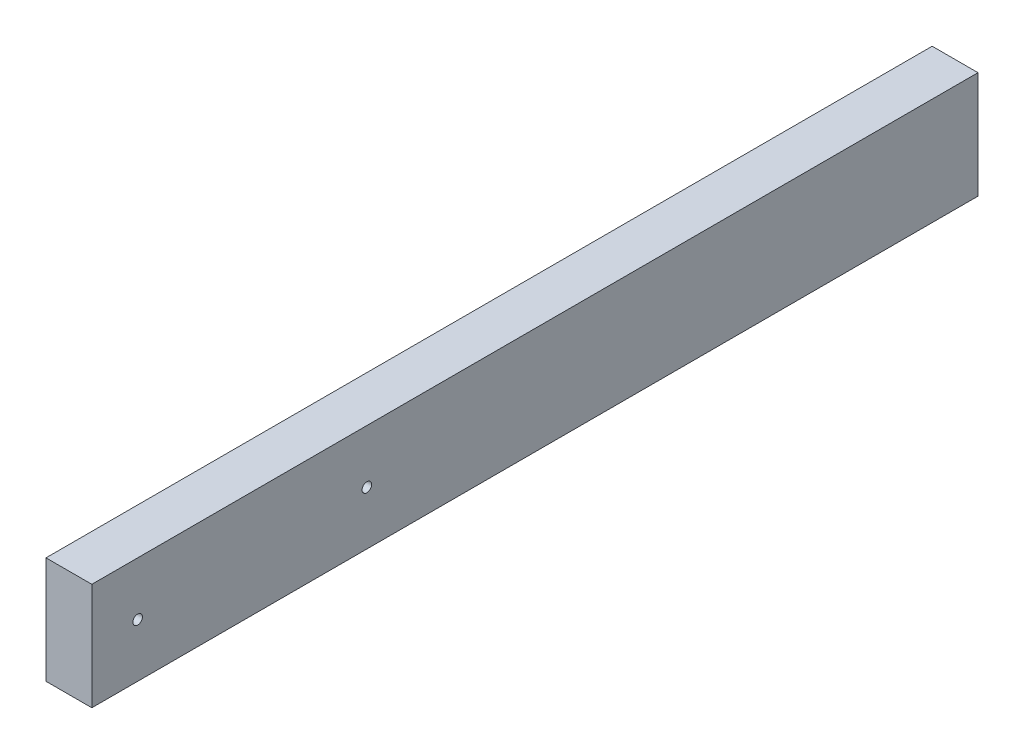
ISO-10303-21;
HEADER;
FILE_DESCRIPTION(('STEP AP214'),'2;1');
FILE_NAME('part.step','',(''),(''),'','','');
FILE_SCHEMA(('AUTOMOTIVE_DESIGN { 1 0 10303 214 1 1 1 1 }'));
ENDSEC;
DATA;
#1=APPLICATION_CONTEXT('core data for automotive mechanical design processes');
#2=APPLICATION_PROTOCOL_DEFINITION('international standard','automotive_design',2000,#1);
#3=PRODUCT_CONTEXT('',#1,'mechanical');
#4=PRODUCT('Part','Part','',(#3));
#5=PRODUCT_RELATED_PRODUCT_CATEGORY('part','',(#4));
#6=PRODUCT_DEFINITION_FORMATION('','',#4);
#7=PRODUCT_DEFINITION_CONTEXT('part definition',#1,'design');
#8=PRODUCT_DEFINITION('design','',#6,#7);
#9=PRODUCT_DEFINITION_SHAPE('','',#8);
#10=(LENGTH_UNIT() NAMED_UNIT(*) SI_UNIT(.MILLI.,.METRE.));
#11=(NAMED_UNIT(*) PLANE_ANGLE_UNIT() SI_UNIT($,.RADIAN.));
#12=(NAMED_UNIT(*) SI_UNIT($,.STERADIAN.) SOLID_ANGLE_UNIT());
#13=UNCERTAINTY_MEASURE_WITH_UNIT(LENGTH_MEASURE(1.E-05),#10,'distance_accuracy_value','');
#14=(GEOMETRIC_REPRESENTATION_CONTEXT(3) GLOBAL_UNCERTAINTY_ASSIGNED_CONTEXT((#13)) GLOBAL_UNIT_ASSIGNED_CONTEXT((#10,
#11,#12)) REPRESENTATION_CONTEXT('',''));
#15=CARTESIAN_POINT('',(0.,0.,0.));
#16=DIRECTION('',(0.,0.,1.));
#17=DIRECTION('',(1.,0.,0.));
#18=AXIS2_PLACEMENT_3D('',#15,#16,#17);
#19=CARTESIAN_POINT('',(19.05,-44.45,736.6));
#20=DIRECTION('',(-1.,0.,0.));
#21=DIRECTION('',(0.,0.,1.));
#22=AXIS2_PLACEMENT_3D('',#19,#20,#21);
#23=PLANE('',#22);
#24=CARTESIAN_POINT('',(19.05,0.,698.5));
#25=DIRECTION('',(1.,0.,0.));
#26=DIRECTION('',(0.,0.,-1.));
#27=AXIS2_PLACEMENT_3D('',#24,#25,#26);
#28=CIRCLE('',#27,3.96875);
#29=CARTESIAN_POINT('',(19.05,0.,694.53125));
#30=VERTEX_POINT('',#29);
#31=EDGE_CURVE('E118',#30,#30,#28,.T.);
#32=ORIENTED_EDGE('',*,*,#31,.F.);
#33=EDGE_LOOP('',(#32));
#34=FACE_BOUND('',#33,.T.);
#35=CARTESIAN_POINT('',(19.05,0.,508.));
#36=DIRECTION('',(1.,0.,0.));
#37=DIRECTION('',(0.,0.,-1.));
#38=AXIS2_PLACEMENT_3D('',#35,#36,#37);
#39=CIRCLE('',#38,3.96875);
#40=CARTESIAN_POINT('',(19.05,0.,504.03125));
#41=VERTEX_POINT('',#40);
#42=EDGE_CURVE('E112',#41,#41,#39,.T.);
#43=ORIENTED_EDGE('',*,*,#42,.F.);
#44=EDGE_LOOP('',(#43));
#45=FACE_BOUND('',#44,.T.);
#46=DIRECTION('',(0.,1.,0.));
#47=VECTOR('',#46,1.);
#48=CARTESIAN_POINT('',(19.05,-44.45,0.));
#49=LINE('',#48,#47);
#50=CARTESIAN_POINT('',(19.05,-44.45,0.));
#51=VERTEX_POINT('',#50);
#52=CARTESIAN_POINT('',(19.05,44.45,0.));
#53=VERTEX_POINT('',#52);
#54=EDGE_CURVE('E96',#51,#53,#49,.T.);
#55=ORIENTED_EDGE('',*,*,#54,.T.);
#56=DIRECTION('',(0.,0.,-1.));
#57=VECTOR('',#56,1.);
#58=CARTESIAN_POINT('',(19.05,44.45,736.6));
#59=LINE('',#58,#57);
#60=CARTESIAN_POINT('',(19.05,44.45,736.6));
#61=VERTEX_POINT('',#60);
#62=EDGE_CURVE('E11',#61,#53,#59,.T.);
#63=ORIENTED_EDGE('',*,*,#62,.F.);
#64=DIRECTION('',(0.,1.,0.));
#65=VECTOR('',#64,1.);
#66=CARTESIAN_POINT('',(19.05,-44.45,736.6));
#67=LINE('',#66,#65);
#68=CARTESIAN_POINT('',(19.05,-44.45,736.6));
#69=VERTEX_POINT('',#68);
#70=EDGE_CURVE('E84',#69,#61,#67,.T.);
#71=ORIENTED_EDGE('',*,*,#70,.F.);
#72=DIRECTION('',(0.,0.,-1.));
#73=VECTOR('',#72,1.);
#74=CARTESIAN_POINT('',(19.05,-44.45,736.6));
#75=LINE('',#74,#73);
#76=EDGE_CURVE('E92',#69,#51,#75,.T.);
#77=ORIENTED_EDGE('',*,*,#76,.T.);
#78=EDGE_LOOP('',(#55,#63,#71,#77));
#79=FACE_BOUND('',#78,.T.);
#80=ADVANCED_FACE('F33',(#34,#45,#79),#23,.F.);
#81=CARTESIAN_POINT('',(-19.05,44.45,736.6));
#82=DIRECTION('',(0.,-1.,0.));
#83=DIRECTION('',(0.,0.,-1.));
#84=AXIS2_PLACEMENT_3D('',#81,#82,#83);
#85=PLANE('',#84);
#86=DIRECTION('',(-1.,0.,0.));
#87=VECTOR('',#86,1.);
#88=CARTESIAN_POINT('',(-19.05,44.45,0.));
#89=LINE('',#88,#87);
#90=CARTESIAN_POINT('',(-19.05,44.45,0.));
#91=VERTEX_POINT('',#90);
#92=EDGE_CURVE('E88',#53,#91,#89,.T.);
#93=ORIENTED_EDGE('',*,*,#92,.T.);
#94=DIRECTION('',(0.,0.,-1.));
#95=VECTOR('',#94,1.);
#96=CARTESIAN_POINT('',(-19.05,44.45,736.6));
#97=LINE('',#96,#95);
#98=CARTESIAN_POINT('',(-19.05,44.45,736.6));
#99=VERTEX_POINT('',#98);
#100=EDGE_CURVE('E41',#99,#91,#97,.T.);
#101=ORIENTED_EDGE('',*,*,#100,.F.);
#102=DIRECTION('',(-1.,0.,0.));
#103=VECTOR('',#102,1.);
#104=CARTESIAN_POINT('',(-19.05,44.45,736.6));
#105=LINE('',#104,#103);
#106=EDGE_CURVE('E79',#61,#99,#105,.T.);
#107=ORIENTED_EDGE('',*,*,#106,.F.);
#108=ORIENTED_EDGE('',*,*,#62,.T.);
#109=EDGE_LOOP('',(#93,#101,#107,#108));
#110=FACE_BOUND('',#109,.T.);
#111=ADVANCED_FACE('F87',(#110),#85,.F.);
#112=CARTESIAN_POINT('',(-19.05,-44.45,736.6));
#113=DIRECTION('',(1.,0.,0.));
#114=DIRECTION('',(0.,0.,-1.));
#115=AXIS2_PLACEMENT_3D('',#112,#113,#114);
#116=PLANE('',#115);
#117=CARTESIAN_POINT('',(-19.05,0.,698.5));
#118=DIRECTION('',(1.,0.,0.));
#119=DIRECTION('',(0.,0.,-1.));
#120=AXIS2_PLACEMENT_3D('',#117,#118,#119);
#121=CIRCLE('',#120,3.96874999999999);
#122=CARTESIAN_POINT('',(-19.05,0.,694.53125));
#123=VERTEX_POINT('',#122);
#124=EDGE_CURVE('E115',#123,#123,#121,.T.);
#125=ORIENTED_EDGE('',*,*,#124,.T.);
#126=EDGE_LOOP('',(#125));
#127=FACE_BOUND('',#126,.T.);
#128=CARTESIAN_POINT('',(-19.05,0.,508.));
#129=DIRECTION('',(1.,0.,0.));
#130=DIRECTION('',(0.,0.,-1.));
#131=AXIS2_PLACEMENT_3D('',#128,#129,#130);
#132=CIRCLE('',#131,3.96874999999999);
#133=CARTESIAN_POINT('',(-19.05,0.,504.03125));
#134=VERTEX_POINT('',#133);
#135=EDGE_CURVE('E99',#134,#134,#132,.T.);
#136=ORIENTED_EDGE('',*,*,#135,.T.);
#137=EDGE_LOOP('',(#136));
#138=FACE_BOUND('',#137,.T.);
#139=DIRECTION('',(0.,-1.,0.));
#140=VECTOR('',#139,1.);
#141=CARTESIAN_POINT('',(-19.05,-44.45,0.));
#142=LINE('',#141,#140);
#143=CARTESIAN_POINT('',(-19.05,-44.45,0.));
#144=VERTEX_POINT('',#143);
#145=EDGE_CURVE('E66',#91,#144,#142,.T.);
#146=ORIENTED_EDGE('',*,*,#145,.T.);
#147=DIRECTION('',(0.,0.,-1.));
#148=VECTOR('',#147,1.);
#149=CARTESIAN_POINT('',(-19.05,-44.45,736.6));
#150=LINE('',#149,#148);
#151=CARTESIAN_POINT('',(-19.05,-44.45,736.6));
#152=VERTEX_POINT('',#151);
#153=EDGE_CURVE('E89',#152,#144,#150,.T.);
#154=ORIENTED_EDGE('',*,*,#153,.F.);
#155=DIRECTION('',(0.,-1.,0.));
#156=VECTOR('',#155,1.);
#157=CARTESIAN_POINT('',(-19.05,-44.45,736.6));
#158=LINE('',#157,#156);
#159=EDGE_CURVE('E82',#99,#152,#158,.T.);
#160=ORIENTED_EDGE('',*,*,#159,.F.);
#161=ORIENTED_EDGE('',*,*,#100,.T.);
#162=EDGE_LOOP('',(#146,#154,#160,#161));
#163=FACE_BOUND('',#162,.T.);
#164=ADVANCED_FACE('F90',(#127,#138,#163),#116,.F.);
#165=CARTESIAN_POINT('',(-19.05,-44.45,736.6));
#166=DIRECTION('',(0.,1.,0.));
#167=DIRECTION('',(0.,0.,1.));
#168=AXIS2_PLACEMENT_3D('',#165,#166,#167);
#169=PLANE('',#168);
#170=DIRECTION('',(1.,0.,0.));
#171=VECTOR('',#170,1.);
#172=CARTESIAN_POINT('',(-19.05,-44.45,0.));
#173=LINE('',#172,#171);
#174=EDGE_CURVE('E72',#144,#51,#173,.T.);
#175=ORIENTED_EDGE('',*,*,#174,.T.);
#176=ORIENTED_EDGE('',*,*,#76,.F.);
#177=DIRECTION('',(1.,0.,0.));
#178=VECTOR('',#177,1.);
#179=CARTESIAN_POINT('',(-19.05,-44.45,736.6));
#180=LINE('',#179,#178);
#181=EDGE_CURVE('E49',#152,#69,#180,.T.);
#182=ORIENTED_EDGE('',*,*,#181,.F.);
#183=ORIENTED_EDGE('',*,*,#153,.T.);
#184=EDGE_LOOP('',(#175,#176,#182,#183));
#185=FACE_BOUND('',#184,.T.);
#186=ADVANCED_FACE('F104',(#185),#169,.F.);
#187=CARTESIAN_POINT('',(0.,0.,736.6));
#188=DIRECTION('',(0.,0.,-1.));
#189=DIRECTION('',(-1.,0.,0.));
#190=AXIS2_PLACEMENT_3D('',#187,#188,#189);
#191=PLANE('',#190);
#192=ORIENTED_EDGE('',*,*,#70,.T.);
#193=ORIENTED_EDGE('',*,*,#106,.T.);
#194=ORIENTED_EDGE('',*,*,#159,.T.);
#195=ORIENTED_EDGE('',*,*,#181,.T.);
#196=EDGE_LOOP('',(#192,#193,#194,#195));
#197=FACE_BOUND('',#196,.T.);
#198=ADVANCED_FACE('F80',(#197),#191,.F.);
#199=CARTESIAN_POINT('',(0.,0.,0.));
#200=DIRECTION('',(0.,0.,-1.));
#201=DIRECTION('',(-1.,0.,0.));
#202=AXIS2_PLACEMENT_3D('',#199,#200,#201);
#203=PLANE('',#202);
#204=ORIENTED_EDGE('',*,*,#54,.F.);
#205=ORIENTED_EDGE('',*,*,#174,.F.);
#206=ORIENTED_EDGE('',*,*,#145,.F.);
#207=ORIENTED_EDGE('',*,*,#92,.F.);
#208=EDGE_LOOP('',(#204,#205,#206,#207));
#209=FACE_BOUND('',#208,.T.);
#210=ADVANCED_FACE('F107',(#209),#203,.T.);
#211=CARTESIAN_POINT('',(19.05,0.,508.));
#212=DIRECTION('',(1.,0.,0.));
#213=DIRECTION('',(0.,0.,-1.));
#214=AXIS2_PLACEMENT_3D('',#211,#212,#213);
#215=CYLINDRICAL_SURFACE('',#214,3.96874999999999);
#216=ORIENTED_EDGE('',*,*,#135,.F.);
#217=EDGE_LOOP('',(#216));
#218=FACE_BOUND('',#217,.T.);
#219=ORIENTED_EDGE('',*,*,#42,.T.);
#220=EDGE_LOOP('',(#219));
#221=FACE_BOUND('',#220,.T.);
#222=ADVANCED_FACE('F128',(#218,#221),#215,.F.);
#223=CARTESIAN_POINT('',(19.05,0.,698.5));
#224=DIRECTION('',(1.,0.,0.));
#225=DIRECTION('',(0.,0.,-1.));
#226=AXIS2_PLACEMENT_3D('',#223,#224,#225);
#227=CYLINDRICAL_SURFACE('',#226,3.96874999999999);
#228=ORIENTED_EDGE('',*,*,#124,.F.);
#229=EDGE_LOOP('',(#228));
#230=FACE_BOUND('',#229,.T.);
#231=ORIENTED_EDGE('',*,*,#31,.T.);
#232=EDGE_LOOP('',(#231));
#233=FACE_BOUND('',#232,.T.);
#234=ADVANCED_FACE('F122',(#230,#233),#227,.F.);
#235=CLOSED_SHELL('',(#80,#111,#164,#186,#198,#210,#222,#234));
#236=MANIFOLD_SOLID_BREP('B2',#235);
#237=ADVANCED_BREP_SHAPE_REPRESENTATION('',(#18,#236),#14);
#238=SHAPE_DEFINITION_REPRESENTATION(#9,#237);
ENDSEC;
END-ISO-10303-21;
